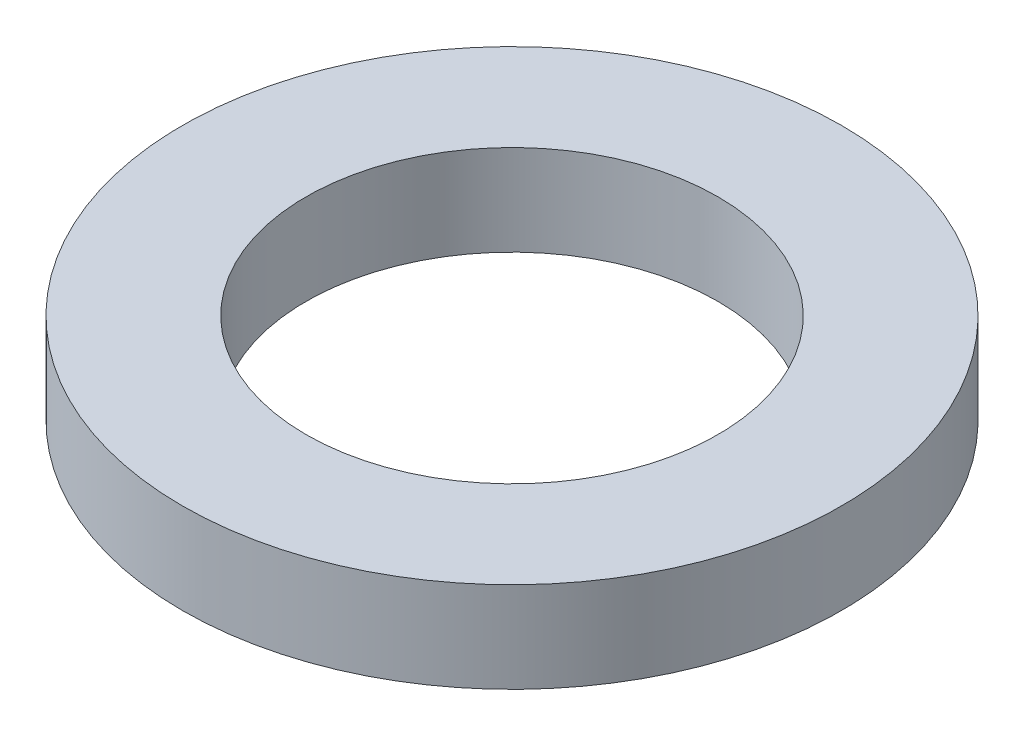
ISO-10303-21;
HEADER;
FILE_DESCRIPTION(('STEP AP214'),'2;1');
FILE_NAME('part.step','',(''),(''),'','','');
FILE_SCHEMA(('AUTOMOTIVE_DESIGN { 1 0 10303 214 1 1 1 1 }'));
ENDSEC;
DATA;
#1=APPLICATION_CONTEXT('core data for automotive mechanical design processes');
#2=APPLICATION_PROTOCOL_DEFINITION('international standard','automotive_design',2000,#1);
#3=PRODUCT_CONTEXT('',#1,'mechanical');
#4=PRODUCT('Part','Part','',(#3));
#5=PRODUCT_RELATED_PRODUCT_CATEGORY('part','',(#4));
#6=PRODUCT_DEFINITION_FORMATION('','',#4);
#7=PRODUCT_DEFINITION_CONTEXT('part definition',#1,'design');
#8=PRODUCT_DEFINITION('design','',#6,#7);
#9=PRODUCT_DEFINITION_SHAPE('','',#8);
#10=(LENGTH_UNIT() NAMED_UNIT(*) SI_UNIT(.MILLI.,.METRE.));
#11=(NAMED_UNIT(*) PLANE_ANGLE_UNIT() SI_UNIT($,.RADIAN.));
#12=(NAMED_UNIT(*) SI_UNIT($,.STERADIAN.) SOLID_ANGLE_UNIT());
#13=UNCERTAINTY_MEASURE_WITH_UNIT(LENGTH_MEASURE(1.E-05),#10,'distance_accuracy_value','');
#14=(GEOMETRIC_REPRESENTATION_CONTEXT(3) GLOBAL_UNCERTAINTY_ASSIGNED_CONTEXT((#13)) GLOBAL_UNIT_ASSIGNED_CONTEXT((#10,
#11,#12)) REPRESENTATION_CONTEXT('',''));
#15=CARTESIAN_POINT('',(0.,0.,0.));
#16=DIRECTION('',(0.,0.,1.));
#17=DIRECTION('',(1.,0.,0.));
#18=AXIS2_PLACEMENT_3D('',#15,#16,#17);
#19=CARTESIAN_POINT('',(0.,11.,0.));
#20=DIRECTION('',(0.,-1.,0.));
#21=DIRECTION('',(0.,0.,-1.));
#22=AXIS2_PLACEMENT_3D('',#19,#20,#21);
#23=CYLINDRICAL_SURFACE('',#22,40.);
#24=CARTESIAN_POINT('',(0.,11.,0.));
#25=DIRECTION('',(0.,1.,0.));
#26=DIRECTION('',(0.,0.,1.));
#27=AXIS2_PLACEMENT_3D('',#24,#25,#26);
#28=CIRCLE('',#27,40.);
#29=CARTESIAN_POINT('',(0.,11.,40.));
#30=VERTEX_POINT('',#29);
#31=EDGE_CURVE('E10',#30,#30,#28,.T.);
#32=ORIENTED_EDGE('',*,*,#31,.F.);
#33=EDGE_LOOP('',(#32));
#34=FACE_BOUND('',#33,.T.);
#35=CARTESIAN_POINT('',(0.,0.,0.));
#36=DIRECTION('',(0.,1.,0.));
#37=DIRECTION('',(0.,0.,1.));
#38=AXIS2_PLACEMENT_3D('',#35,#36,#37);
#39=CIRCLE('',#38,40.);
#40=CARTESIAN_POINT('',(0.,0.,40.));
#41=VERTEX_POINT('',#40);
#42=EDGE_CURVE('E37',#41,#41,#39,.T.);
#43=ORIENTED_EDGE('',*,*,#42,.T.);
#44=EDGE_LOOP('',(#43));
#45=FACE_BOUND('',#44,.T.);
#46=ADVANCED_FACE('F40',(#34,#45),#23,.T.);
#47=CARTESIAN_POINT('',(0.,11.,0.));
#48=DIRECTION('',(0.,1.,0.));
#49=DIRECTION('',(0.,0.,1.));
#50=AXIS2_PLACEMENT_3D('',#47,#48,#49);
#51=PLANE('',#50);
#52=CARTESIAN_POINT('',(0.,11.,0.));
#53=DIRECTION('',(0.,1.,0.));
#54=DIRECTION('',(0.,0.,1.));
#55=AXIS2_PLACEMENT_3D('',#52,#53,#54);
#56=CIRCLE('',#55,25.);
#57=CARTESIAN_POINT('',(0.,11.,25.));
#58=VERTEX_POINT('',#57);
#59=EDGE_CURVE('E50',#58,#58,#56,.T.);
#60=ORIENTED_EDGE('',*,*,#59,.F.);
#61=EDGE_LOOP('',(#60));
#62=FACE_BOUND('',#61,.T.);
#63=ORIENTED_EDGE('',*,*,#31,.T.);
#64=EDGE_LOOP('',(#63));
#65=FACE_BOUND('',#64,.T.);
#66=ADVANCED_FACE('F59',(#62,#65),#51,.T.);
#67=CARTESIAN_POINT('',(0.,0.,0.));
#68=DIRECTION('',(0.,1.,0.));
#69=DIRECTION('',(0.,0.,1.));
#70=AXIS2_PLACEMENT_3D('',#67,#68,#69);
#71=PLANE('',#70);
#72=CARTESIAN_POINT('',(0.,0.,0.));
#73=DIRECTION('',(0.,1.,0.));
#74=DIRECTION('',(0.,0.,1.));
#75=AXIS2_PLACEMENT_3D('',#72,#73,#74);
#76=CIRCLE('',#75,25.);
#77=CARTESIAN_POINT('',(0.,0.,25.));
#78=VERTEX_POINT('',#77);
#79=EDGE_CURVE('E47',#78,#78,#76,.T.);
#80=ORIENTED_EDGE('',*,*,#79,.T.);
#81=EDGE_LOOP('',(#80));
#82=FACE_BOUND('',#81,.T.);
#83=ORIENTED_EDGE('',*,*,#42,.F.);
#84=EDGE_LOOP('',(#83));
#85=FACE_BOUND('',#84,.T.);
#86=ADVANCED_FACE('F58',(#82,#85),#71,.F.);
#87=CARTESIAN_POINT('',(0.,11.,0.));
#88=DIRECTION('',(0.,-1.,0.));
#89=DIRECTION('',(0.,0.,-1.));
#90=AXIS2_PLACEMENT_3D('',#87,#88,#89);
#91=CYLINDRICAL_SURFACE('',#90,25.);
#92=ORIENTED_EDGE('',*,*,#59,.T.);
#93=EDGE_LOOP('',(#92));
#94=FACE_BOUND('',#93,.T.);
#95=ORIENTED_EDGE('',*,*,#79,.F.);
#96=EDGE_LOOP('',(#95));
#97=FACE_BOUND('',#96,.T.);
#98=ADVANCED_FACE('F54',(#94,#97),#91,.F.);
#99=CLOSED_SHELL('',(#46,#66,#86,#98));
#100=MANIFOLD_SOLID_BREP('B2',#99);
#101=ADVANCED_BREP_SHAPE_REPRESENTATION('',(#18,#100),#14);
#102=SHAPE_DEFINITION_REPRESENTATION(#9,#101);
ENDSEC;
END-ISO-10303-21;
